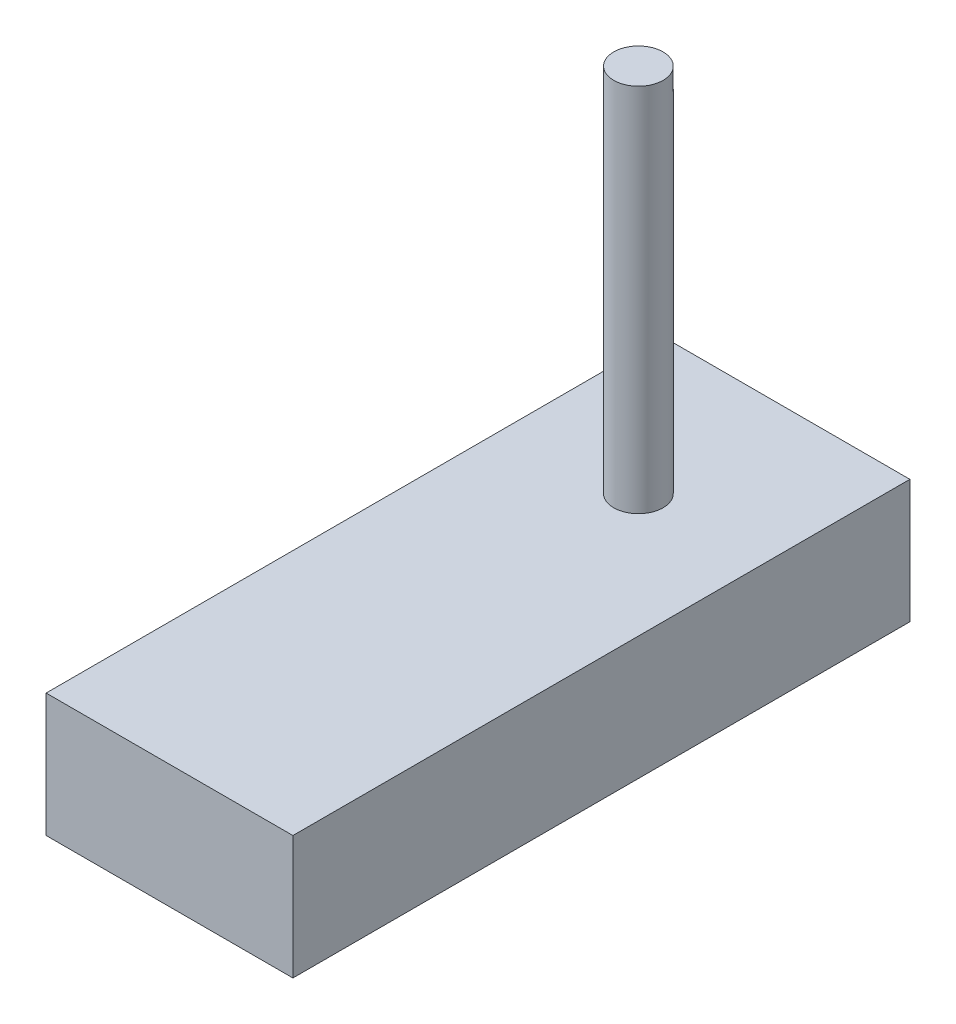
ISO-10303-21;
HEADER;
FILE_DESCRIPTION(('STEP AP214'),'2;1');
FILE_NAME('part.step','',(''),(''),'','','');
FILE_SCHEMA(('AUTOMOTIVE_DESIGN { 1 0 10303 214 1 1 1 1 }'));
ENDSEC;
DATA;
#1=APPLICATION_CONTEXT('core data for automotive mechanical design processes');
#2=APPLICATION_PROTOCOL_DEFINITION('international standard','automotive_design',2000,#1);
#3=PRODUCT_CONTEXT('',#1,'mechanical');
#4=PRODUCT('Part','Part','',(#3));
#5=PRODUCT_RELATED_PRODUCT_CATEGORY('part','',(#4));
#6=PRODUCT_DEFINITION_FORMATION('','',#4);
#7=PRODUCT_DEFINITION_CONTEXT('part definition',#1,'design');
#8=PRODUCT_DEFINITION('design','',#6,#7);
#9=PRODUCT_DEFINITION_SHAPE('','',#8);
#10=(LENGTH_UNIT() NAMED_UNIT(*) SI_UNIT(.MILLI.,.METRE.));
#11=(NAMED_UNIT(*) PLANE_ANGLE_UNIT() SI_UNIT($,.RADIAN.));
#12=(NAMED_UNIT(*) SI_UNIT($,.STERADIAN.) SOLID_ANGLE_UNIT());
#13=UNCERTAINTY_MEASURE_WITH_UNIT(LENGTH_MEASURE(1.E-05),#10,'distance_accuracy_value','');
#14=(GEOMETRIC_REPRESENTATION_CONTEXT(3) GLOBAL_UNCERTAINTY_ASSIGNED_CONTEXT((#13)) GLOBAL_UNIT_ASSIGNED_CONTEXT((#10,
#11,#12)) REPRESENTATION_CONTEXT('',''));
#15=CARTESIAN_POINT('',(0.,0.,0.));
#16=DIRECTION('',(0.,0.,1.));
#17=DIRECTION('',(1.,0.,0.));
#18=AXIS2_PLACEMENT_3D('',#15,#16,#17);
#19=CARTESIAN_POINT('',(5.,5.,12.5));
#20=DIRECTION('',(-1.,0.,0.));
#21=DIRECTION('',(0.,0.,1.));
#22=AXIS2_PLACEMENT_3D('',#19,#20,#21);
#23=PLANE('',#22);
#24=DIRECTION('',(0.,0.,-1.));
#25=VECTOR('',#24,1.);
#26=CARTESIAN_POINT('',(5.,0.,12.5));
#27=LINE('',#26,#25);
#28=CARTESIAN_POINT('',(5.,0.,12.5));
#29=VERTEX_POINT('',#28);
#30=CARTESIAN_POINT('',(5.,0.,-12.5));
#31=VERTEX_POINT('',#30);
#32=EDGE_CURVE('E99',#29,#31,#27,.T.);
#33=ORIENTED_EDGE('',*,*,#32,.T.);
#34=DIRECTION('',(0.,-1.,0.));
#35=VECTOR('',#34,1.);
#36=CARTESIAN_POINT('',(5.,5.,-12.5));
#37=LINE('',#36,#35);
#38=CARTESIAN_POINT('',(5.,5.,-12.5));
#39=VERTEX_POINT('',#38);
#40=EDGE_CURVE('E41',#39,#31,#37,.T.);
#41=ORIENTED_EDGE('',*,*,#40,.F.);
#42=DIRECTION('',(0.,0.,-1.));
#43=VECTOR('',#42,1.);
#44=CARTESIAN_POINT('',(5.,5.,12.5));
#45=LINE('',#44,#43);
#46=CARTESIAN_POINT('',(5.,5.,12.5));
#47=VERTEX_POINT('',#46);
#48=EDGE_CURVE('E85',#47,#39,#45,.T.);
#49=ORIENTED_EDGE('',*,*,#48,.F.);
#50=DIRECTION('',(0.,-1.,0.));
#51=VECTOR('',#50,1.);
#52=CARTESIAN_POINT('',(5.,5.,12.5));
#53=LINE('',#52,#51);
#54=EDGE_CURVE('E95',#47,#29,#53,.T.);
#55=ORIENTED_EDGE('',*,*,#54,.T.);
#56=EDGE_LOOP('',(#33,#41,#49,#55));
#57=FACE_BOUND('',#56,.T.);
#58=ADVANCED_FACE('F33',(#57),#23,.F.);
#59=CARTESIAN_POINT('',(-5.,5.,-12.5));
#60=DIRECTION('',(0.,0.,1.));
#61=DIRECTION('',(1.,0.,0.));
#62=AXIS2_PLACEMENT_3D('',#59,#60,#61);
#63=PLANE('',#62);
#64=DIRECTION('',(-1.,0.,0.));
#65=VECTOR('',#64,1.);
#66=CARTESIAN_POINT('',(-5.,0.,-12.5));
#67=LINE('',#66,#65);
#68=CARTESIAN_POINT('',(-5.,0.,-12.5));
#69=VERTEX_POINT('',#68);
#70=EDGE_CURVE('E90',#31,#69,#67,.T.);
#71=ORIENTED_EDGE('',*,*,#70,.T.);
#72=DIRECTION('',(0.,-1.,0.));
#73=VECTOR('',#72,1.);
#74=CARTESIAN_POINT('',(-5.,5.,-12.5));
#75=LINE('',#74,#73);
#76=CARTESIAN_POINT('',(-5.,5.,-12.5));
#77=VERTEX_POINT('',#76);
#78=EDGE_CURVE('E88',#77,#69,#75,.T.);
#79=ORIENTED_EDGE('',*,*,#78,.F.);
#80=DIRECTION('',(-1.,0.,0.));
#81=VECTOR('',#80,1.);
#82=CARTESIAN_POINT('',(-5.,5.,-12.5));
#83=LINE('',#82,#81);
#84=EDGE_CURVE('E80',#39,#77,#83,.T.);
#85=ORIENTED_EDGE('',*,*,#84,.F.);
#86=ORIENTED_EDGE('',*,*,#40,.T.);
#87=EDGE_LOOP('',(#71,#79,#85,#86));
#88=FACE_BOUND('',#87,.T.);
#89=ADVANCED_FACE('F89',(#88),#63,.F.);
#90=CARTESIAN_POINT('',(-5.,5.,12.5));
#91=DIRECTION('',(1.,0.,0.));
#92=DIRECTION('',(0.,0.,-1.));
#93=AXIS2_PLACEMENT_3D('',#90,#91,#92);
#94=PLANE('',#93);
#95=DIRECTION('',(0.,0.,1.));
#96=VECTOR('',#95,1.);
#97=CARTESIAN_POINT('',(-5.,0.,12.5));
#98=LINE('',#97,#96);
#99=CARTESIAN_POINT('',(-5.,0.,12.5));
#100=VERTEX_POINT('',#99);
#101=EDGE_CURVE('E66',#69,#100,#98,.T.);
#102=ORIENTED_EDGE('',*,*,#101,.T.);
#103=DIRECTION('',(0.,-1.,0.));
#104=VECTOR('',#103,1.);
#105=CARTESIAN_POINT('',(-5.,5.,12.5));
#106=LINE('',#105,#104);
#107=CARTESIAN_POINT('',(-5.,5.,12.5));
#108=VERTEX_POINT('',#107);
#109=EDGE_CURVE('E91',#108,#100,#106,.T.);
#110=ORIENTED_EDGE('',*,*,#109,.F.);
#111=DIRECTION('',(0.,0.,1.));
#112=VECTOR('',#111,1.);
#113=CARTESIAN_POINT('',(-5.,5.,12.5));
#114=LINE('',#113,#112);
#115=EDGE_CURVE('E83',#77,#108,#114,.T.);
#116=ORIENTED_EDGE('',*,*,#115,.F.);
#117=ORIENTED_EDGE('',*,*,#78,.T.);
#118=EDGE_LOOP('',(#102,#110,#116,#117));
#119=FACE_BOUND('',#118,.T.);
#120=ADVANCED_FACE('F93',(#119),#94,.F.);
#121=CARTESIAN_POINT('',(-5.,5.,12.5));
#122=DIRECTION('',(0.,0.,-1.));
#123=DIRECTION('',(-1.,0.,0.));
#124=AXIS2_PLACEMENT_3D('',#121,#122,#123);
#125=PLANE('',#124);
#126=DIRECTION('',(1.,0.,0.));
#127=VECTOR('',#126,1.);
#128=CARTESIAN_POINT('',(-5.,0.,12.5));
#129=LINE('',#128,#127);
#130=EDGE_CURVE('E72',#100,#29,#129,.T.);
#131=ORIENTED_EDGE('',*,*,#130,.T.);
#132=ORIENTED_EDGE('',*,*,#54,.F.);
#133=DIRECTION('',(1.,0.,0.));
#134=VECTOR('',#133,1.);
#135=CARTESIAN_POINT('',(-5.,5.,12.5));
#136=LINE('',#135,#134);
#137=EDGE_CURVE('E49',#108,#47,#136,.T.);
#138=ORIENTED_EDGE('',*,*,#137,.F.);
#139=ORIENTED_EDGE('',*,*,#109,.T.);
#140=EDGE_LOOP('',(#131,#132,#138,#139));
#141=FACE_BOUND('',#140,.T.);
#142=ADVANCED_FACE('F121',(#141),#125,.F.);
#143=CARTESIAN_POINT('',(0.,5.,0.));
#144=DIRECTION('',(0.,-1.,0.));
#145=DIRECTION('',(0.,0.,-1.));
#146=AXIS2_PLACEMENT_3D('',#143,#144,#145);
#147=PLANE('',#146);
#148=CARTESIAN_POINT('',(0.,5.,-6.5));
#149=DIRECTION('',(0.,-1.,0.));
#150=DIRECTION('',(0.,0.,-1.));
#151=AXIS2_PLACEMENT_3D('',#148,#149,#150);
#152=CIRCLE('',#151,1.);
#153=CARTESIAN_POINT('',(0.,5.,-7.5));
#154=VERTEX_POINT('',#153);
#155=EDGE_CURVE('E11',#154,#154,#152,.F.);
#156=ORIENTED_EDGE('',*,*,#155,.F.);
#157=EDGE_LOOP('',(#156));
#158=FACE_BOUND('',#157,.T.);
#159=ORIENTED_EDGE('',*,*,#48,.T.);
#160=ORIENTED_EDGE('',*,*,#84,.T.);
#161=ORIENTED_EDGE('',*,*,#115,.T.);
#162=ORIENTED_EDGE('',*,*,#137,.T.);
#163=EDGE_LOOP('',(#159,#160,#161,#162));
#164=FACE_BOUND('',#163,.T.);
#165=ADVANCED_FACE('F81',(#158,#164),#147,.F.);
#166=CARTESIAN_POINT('',(0.,0.,0.));
#167=DIRECTION('',(0.,-1.,0.));
#168=DIRECTION('',(0.,0.,-1.));
#169=AXIS2_PLACEMENT_3D('',#166,#167,#168);
#170=PLANE('',#169);
#171=ORIENTED_EDGE('',*,*,#32,.F.);
#172=ORIENTED_EDGE('',*,*,#130,.F.);
#173=ORIENTED_EDGE('',*,*,#101,.F.);
#174=ORIENTED_EDGE('',*,*,#70,.F.);
#175=EDGE_LOOP('',(#171,#172,#173,#174));
#176=FACE_BOUND('',#175,.T.);
#177=ADVANCED_FACE('F110',(#176),#170,.T.);
#178=CARTESIAN_POINT('',(0.,20.,-6.5));
#179=DIRECTION('',(0.,-1.,0.));
#180=DIRECTION('',(0.,0.,-1.));
#181=AXIS2_PLACEMENT_3D('',#178,#179,#180);
#182=CYLINDRICAL_SURFACE('',#181,1.);
#183=CARTESIAN_POINT('',(0.,20.,-6.5));
#184=DIRECTION('',(0.,1.,0.));
#185=DIRECTION('',(0.,0.,1.));
#186=AXIS2_PLACEMENT_3D('',#183,#184,#185);
#187=CIRCLE('',#186,1.);
#188=CARTESIAN_POINT('',(0.,20.,-5.5));
#189=VERTEX_POINT('',#188);
#190=EDGE_CURVE('E102',#189,#189,#187,.T.);
#191=ORIENTED_EDGE('',*,*,#190,.F.);
#192=EDGE_LOOP('',(#191));
#193=FACE_BOUND('',#192,.T.);
#194=ORIENTED_EDGE('',*,*,#155,.T.);
#195=EDGE_LOOP('',(#194));
#196=FACE_BOUND('',#195,.T.);
#197=ADVANCED_FACE('F112',(#193,#196),#182,.T.);
#198=CARTESIAN_POINT('',(0.,20.,-6.5));
#199=DIRECTION('',(0.,1.,0.));
#200=DIRECTION('',(0.,0.,1.));
#201=AXIS2_PLACEMENT_3D('',#198,#199,#200);
#202=PLANE('',#201);
#203=ORIENTED_EDGE('',*,*,#190,.T.);
#204=EDGE_LOOP('',(#203));
#205=FACE_BOUND('',#204,.T.);
#206=ADVANCED_FACE('F118',(#205),#202,.T.);
#207=CLOSED_SHELL('',(#58,#89,#120,#142,#165,#177,#197,#206));
#208=MANIFOLD_SOLID_BREP('B2',#207);
#209=ADVANCED_BREP_SHAPE_REPRESENTATION('',(#18,#208),#14);
#210=SHAPE_DEFINITION_REPRESENTATION(#9,#209);
ENDSEC;
END-ISO-10303-21;
